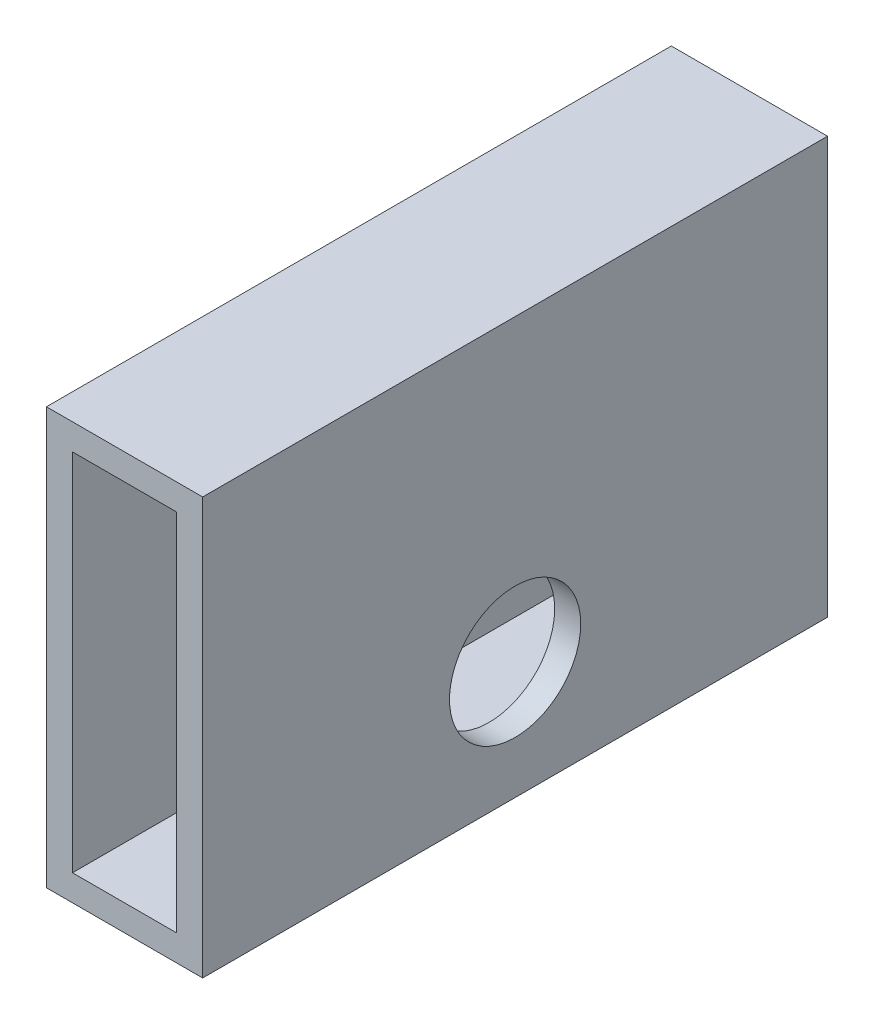
ISO-10303-21;
HEADER;
FILE_DESCRIPTION(('STEP AP214'),'2;1');
FILE_NAME('part.step','',(''),(''),'','','');
FILE_SCHEMA(('AUTOMOTIVE_DESIGN { 1 0 10303 214 1 1 1 1 }'));
ENDSEC;
DATA;
#1=APPLICATION_CONTEXT('core data for automotive mechanical design processes');
#2=APPLICATION_PROTOCOL_DEFINITION('international standard','automotive_design',2000,#1);
#3=PRODUCT_CONTEXT('',#1,'mechanical');
#4=PRODUCT('Part','Part','',(#3));
#5=PRODUCT_RELATED_PRODUCT_CATEGORY('part','',(#4));
#6=PRODUCT_DEFINITION_FORMATION('','',#4);
#7=PRODUCT_DEFINITION_CONTEXT('part definition',#1,'design');
#8=PRODUCT_DEFINITION('design','',#6,#7);
#9=PRODUCT_DEFINITION_SHAPE('','',#8);
#10=(LENGTH_UNIT() NAMED_UNIT(*) SI_UNIT(.MILLI.,.METRE.));
#11=(NAMED_UNIT(*) PLANE_ANGLE_UNIT() SI_UNIT($,.RADIAN.));
#12=(NAMED_UNIT(*) SI_UNIT($,.STERADIAN.) SOLID_ANGLE_UNIT());
#13=UNCERTAINTY_MEASURE_WITH_UNIT(LENGTH_MEASURE(1.E-05),#10,'distance_accuracy_value','');
#14=(GEOMETRIC_REPRESENTATION_CONTEXT(3) GLOBAL_UNCERTAINTY_ASSIGNED_CONTEXT((#13)) GLOBAL_UNIT_ASSIGNED_CONTEXT((#10,
#11,#12)) REPRESENTATION_CONTEXT('',''));
#15=CARTESIAN_POINT('',(0.,0.,0.));
#16=DIRECTION('',(0.,0.,1.));
#17=DIRECTION('',(1.,0.,0.));
#18=AXIS2_PLACEMENT_3D('',#15,#16,#17);
#19=CARTESIAN_POINT('',(9.525,-25.4,-76.2));
#20=DIRECTION('',(1.,0.,0.));
#21=DIRECTION('',(0.,0.,-1.));
#22=AXIS2_PLACEMENT_3D('',#19,#20,#21);
#23=PLANE('',#22);
#24=CARTESIAN_POINT('',(9.525,-11.049,-38.1));
#25=DIRECTION('',(1.,0.,0.));
#26=DIRECTION('',(0.,0.,-1.));
#27=AXIS2_PLACEMENT_3D('',#24,#25,#26);
#28=CIRCLE('',#27,8.001);
#29=CARTESIAN_POINT('',(9.525,-11.049,-46.101));
#30=VERTEX_POINT('',#29);
#31=EDGE_CURVE('E220',#30,#30,#28,.T.);
#32=ORIENTED_EDGE('',*,*,#31,.F.);
#33=EDGE_LOOP('',(#32));
#34=FACE_BOUND('',#33,.T.);
#35=DIRECTION('',(0.,1.,0.));
#36=VECTOR('',#35,1.);
#37=CARTESIAN_POINT('',(9.525,-25.4,0.));
#38=LINE('',#37,#36);
#39=CARTESIAN_POINT('',(9.525,-25.4,0.));
#40=VERTEX_POINT('',#39);
#41=CARTESIAN_POINT('',(9.525,25.4,0.));
#42=VERTEX_POINT('',#41);
#43=EDGE_CURVE('E112',#40,#42,#38,.T.);
#44=ORIENTED_EDGE('',*,*,#43,.F.);
#45=DIRECTION('',(0.,0.,1.));
#46=VECTOR('',#45,1.);
#47=CARTESIAN_POINT('',(9.525,-25.4,-76.2));
#48=LINE('',#47,#46);
#49=CARTESIAN_POINT('',(9.525,-25.4,-76.2));
#50=VERTEX_POINT('',#49);
#51=EDGE_CURVE('E11',#50,#40,#48,.T.);
#52=ORIENTED_EDGE('',*,*,#51,.F.);
#53=DIRECTION('',(0.,1.,0.));
#54=VECTOR('',#53,1.);
#55=CARTESIAN_POINT('',(9.525,-25.4,-76.2));
#56=LINE('',#55,#54);
#57=CARTESIAN_POINT('',(9.525,25.4,-76.2));
#58=VERTEX_POINT('',#57);
#59=EDGE_CURVE('E151',#50,#58,#56,.T.);
#60=ORIENTED_EDGE('',*,*,#59,.T.);
#61=DIRECTION('',(0.,0.,1.));
#62=VECTOR('',#61,1.);
#63=CARTESIAN_POINT('',(9.525,25.4,-76.2));
#64=LINE('',#63,#62);
#65=EDGE_CURVE('E168',#58,#42,#64,.T.);
#66=ORIENTED_EDGE('',*,*,#65,.T.);
#67=EDGE_LOOP('',(#44,#52,#60,#66));
#68=FACE_BOUND('',#67,.T.);
#69=ADVANCED_FACE('F39',(#34,#68),#23,.T.);
#70=CARTESIAN_POINT('',(-9.525,-25.4,-76.2));
#71=DIRECTION('',(0.,-1.,0.));
#72=DIRECTION('',(0.,0.,-1.));
#73=AXIS2_PLACEMENT_3D('',#70,#71,#72);
#74=PLANE('',#73);
#75=DIRECTION('',(1.,0.,0.));
#76=VECTOR('',#75,1.);
#77=CARTESIAN_POINT('',(-9.525,-25.4,0.));
#78=LINE('',#77,#76);
#79=CARTESIAN_POINT('',(-9.525,-25.4,0.));
#80=VERTEX_POINT('',#79);
#81=EDGE_CURVE('E156',#80,#40,#78,.T.);
#82=ORIENTED_EDGE('',*,*,#81,.F.);
#83=DIRECTION('',(0.,0.,1.));
#84=VECTOR('',#83,1.);
#85=CARTESIAN_POINT('',(-9.525,-25.4,-76.2));
#86=LINE('',#85,#84);
#87=CARTESIAN_POINT('',(-9.525,-25.4,-76.2));
#88=VERTEX_POINT('',#87);
#89=EDGE_CURVE('E48',#88,#80,#86,.T.);
#90=ORIENTED_EDGE('',*,*,#89,.F.);
#91=DIRECTION('',(1.,0.,0.));
#92=VECTOR('',#91,1.);
#93=CARTESIAN_POINT('',(-9.525,-25.4,-76.2));
#94=LINE('',#93,#92);
#95=EDGE_CURVE('E164',#88,#50,#94,.T.);
#96=ORIENTED_EDGE('',*,*,#95,.T.);
#97=ORIENTED_EDGE('',*,*,#51,.T.);
#98=EDGE_LOOP('',(#82,#90,#96,#97));
#99=FACE_BOUND('',#98,.T.);
#100=ADVANCED_FACE('F200',(#99),#74,.T.);
#101=CARTESIAN_POINT('',(-9.525,-25.4,-76.2));
#102=DIRECTION('',(-1.,0.,0.));
#103=DIRECTION('',(0.,0.,1.));
#104=AXIS2_PLACEMENT_3D('',#101,#102,#103);
#105=PLANE('',#104);
#106=CARTESIAN_POINT('',(-9.525,-11.049,-38.1));
#107=DIRECTION('',(1.,0.,0.));
#108=DIRECTION('',(0.,0.,-1.));
#109=AXIS2_PLACEMENT_3D('',#106,#107,#108);
#110=CIRCLE('',#109,8.001);
#111=CARTESIAN_POINT('',(-9.525,-11.049,-46.101));
#112=VERTEX_POINT('',#111);
#113=EDGE_CURVE('E223',#112,#112,#110,.T.);
#114=ORIENTED_EDGE('',*,*,#113,.T.);
#115=EDGE_LOOP('',(#114));
#116=FACE_BOUND('',#115,.T.);
#117=DIRECTION('',(0.,-1.,0.));
#118=VECTOR('',#117,1.);
#119=CARTESIAN_POINT('',(-9.525,-25.4,0.));
#120=LINE('',#119,#118);
#121=CARTESIAN_POINT('',(-9.525,25.4,0.));
#122=VERTEX_POINT('',#121);
#123=EDGE_CURVE('E176',#122,#80,#120,.T.);
#124=ORIENTED_EDGE('',*,*,#123,.F.);
#125=DIRECTION('',(0.,0.,1.));
#126=VECTOR('',#125,1.);
#127=CARTESIAN_POINT('',(-9.525,25.4,-76.2));
#128=LINE('',#127,#126);
#129=CARTESIAN_POINT('',(-9.525,25.4,-76.2));
#130=VERTEX_POINT('',#129);
#131=EDGE_CURVE('E185',#130,#122,#128,.T.);
#132=ORIENTED_EDGE('',*,*,#131,.F.);
#133=DIRECTION('',(0.,-1.,0.));
#134=VECTOR('',#133,1.);
#135=CARTESIAN_POINT('',(-9.525,-25.4,-76.2));
#136=LINE('',#135,#134);
#137=EDGE_CURVE('E160',#130,#88,#136,.T.);
#138=ORIENTED_EDGE('',*,*,#137,.T.);
#139=ORIENTED_EDGE('',*,*,#89,.T.);
#140=EDGE_LOOP('',(#124,#132,#138,#139));
#141=FACE_BOUND('',#140,.T.);
#142=ADVANCED_FACE('F204',(#116,#141),#105,.T.);
#143=CARTESIAN_POINT('',(-9.525,25.4,-76.2));
#144=DIRECTION('',(0.,1.,0.));
#145=DIRECTION('',(0.,0.,1.));
#146=AXIS2_PLACEMENT_3D('',#143,#144,#145);
#147=PLANE('',#146);
#148=DIRECTION('',(-1.,0.,0.));
#149=VECTOR('',#148,1.);
#150=CARTESIAN_POINT('',(-9.525,25.4,0.));
#151=LINE('',#150,#149);
#152=EDGE_CURVE('E172',#42,#122,#151,.T.);
#153=ORIENTED_EDGE('',*,*,#152,.F.);
#154=ORIENTED_EDGE('',*,*,#65,.F.);
#155=DIRECTION('',(-1.,0.,0.));
#156=VECTOR('',#155,1.);
#157=CARTESIAN_POINT('',(-9.525,25.4,-76.2));
#158=LINE('',#157,#156);
#159=EDGE_CURVE('E155',#58,#130,#158,.T.);
#160=ORIENTED_EDGE('',*,*,#159,.T.);
#161=ORIENTED_EDGE('',*,*,#131,.T.);
#162=EDGE_LOOP('',(#153,#154,#160,#161));
#163=FACE_BOUND('',#162,.T.);
#164=ADVANCED_FACE('F194',(#163),#147,.T.);
#165=CARTESIAN_POINT('',(0.,0.,-76.2));
#166=DIRECTION('',(0.,0.,-1.));
#167=DIRECTION('',(-1.,0.,0.));
#168=AXIS2_PLACEMENT_3D('',#165,#166,#167);
#169=PLANE('',#168);
#170=DIRECTION('',(0.,1.,0.));
#171=VECTOR('',#170,1.);
#172=CARTESIAN_POINT('',(6.35,-22.225,-76.2));
#173=LINE('',#172,#171);
#174=CARTESIAN_POINT('',(6.35,-22.225,-76.2));
#175=VERTEX_POINT('',#174);
#176=CARTESIAN_POINT('',(6.35,22.225,-76.2));
#177=VERTEX_POINT('',#176);
#178=EDGE_CURVE('E116',#175,#177,#173,.T.);
#179=ORIENTED_EDGE('',*,*,#178,.T.);
#180=DIRECTION('',(-1.,0.,0.));
#181=VECTOR('',#180,1.);
#182=CARTESIAN_POINT('',(-6.35,22.225,-76.2));
#183=LINE('',#182,#181);
#184=CARTESIAN_POINT('',(-6.35,22.225,-76.2));
#185=VERTEX_POINT('',#184);
#186=EDGE_CURVE('E104',#177,#185,#183,.T.);
#187=ORIENTED_EDGE('',*,*,#186,.T.);
#188=DIRECTION('',(0.,-1.,0.));
#189=VECTOR('',#188,1.);
#190=CARTESIAN_POINT('',(-6.35,-22.225,-76.2));
#191=LINE('',#190,#189);
#192=CARTESIAN_POINT('',(-6.35,-22.225,-76.2));
#193=VERTEX_POINT('',#192);
#194=EDGE_CURVE('E131',#185,#193,#191,.T.);
#195=ORIENTED_EDGE('',*,*,#194,.T.);
#196=DIRECTION('',(1.,0.,0.));
#197=VECTOR('',#196,1.);
#198=CARTESIAN_POINT('',(-6.35,-22.225,-76.2));
#199=LINE('',#198,#197);
#200=EDGE_CURVE('E124',#193,#175,#199,.T.);
#201=ORIENTED_EDGE('',*,*,#200,.T.);
#202=EDGE_LOOP('',(#179,#187,#195,#201));
#203=FACE_BOUND('',#202,.T.);
#204=ORIENTED_EDGE('',*,*,#59,.F.);
#205=ORIENTED_EDGE('',*,*,#95,.F.);
#206=ORIENTED_EDGE('',*,*,#137,.F.);
#207=ORIENTED_EDGE('',*,*,#159,.F.);
#208=EDGE_LOOP('',(#204,#205,#206,#207));
#209=FACE_BOUND('',#208,.T.);
#210=ADVANCED_FACE('F122',(#203,#209),#169,.T.);
#211=CARTESIAN_POINT('',(0.,0.,0.));
#212=DIRECTION('',(0.,0.,-1.));
#213=DIRECTION('',(-1.,0.,0.));
#214=AXIS2_PLACEMENT_3D('',#211,#212,#213);
#215=PLANE('',#214);
#216=DIRECTION('',(-1.,0.,0.));
#217=VECTOR('',#216,1.);
#218=CARTESIAN_POINT('',(-6.35,22.225,0.));
#219=LINE('',#218,#217);
#220=CARTESIAN_POINT('',(6.35,22.225,0.));
#221=VERTEX_POINT('',#220);
#222=CARTESIAN_POINT('',(-6.35,22.225,0.));
#223=VERTEX_POINT('',#222);
#224=EDGE_CURVE('E129',#221,#223,#219,.T.);
#225=ORIENTED_EDGE('',*,*,#224,.F.);
#226=DIRECTION('',(0.,1.,0.));
#227=VECTOR('',#226,1.);
#228=CARTESIAN_POINT('',(6.35,-22.225,0.));
#229=LINE('',#228,#227);
#230=CARTESIAN_POINT('',(6.35,-22.225,0.));
#231=VERTEX_POINT('',#230);
#232=EDGE_CURVE('E64',#231,#221,#229,.T.);
#233=ORIENTED_EDGE('',*,*,#232,.F.);
#234=DIRECTION('',(1.,0.,0.));
#235=VECTOR('',#234,1.);
#236=CARTESIAN_POINT('',(-6.35,-22.225,0.));
#237=LINE('',#236,#235);
#238=CARTESIAN_POINT('',(-6.35,-22.225,0.));
#239=VERTEX_POINT('',#238);
#240=EDGE_CURVE('E119',#239,#231,#237,.T.);
#241=ORIENTED_EDGE('',*,*,#240,.F.);
#242=DIRECTION('',(0.,-1.,0.));
#243=VECTOR('',#242,1.);
#244=CARTESIAN_POINT('',(-6.35,-22.225,0.));
#245=LINE('',#244,#243);
#246=EDGE_CURVE('E137',#223,#239,#245,.T.);
#247=ORIENTED_EDGE('',*,*,#246,.F.);
#248=EDGE_LOOP('',(#225,#233,#241,#247));
#249=FACE_BOUND('',#248,.T.);
#250=ORIENTED_EDGE('',*,*,#43,.T.);
#251=ORIENTED_EDGE('',*,*,#152,.T.);
#252=ORIENTED_EDGE('',*,*,#123,.T.);
#253=ORIENTED_EDGE('',*,*,#81,.T.);
#254=EDGE_LOOP('',(#250,#251,#252,#253));
#255=FACE_BOUND('',#254,.T.);
#256=ADVANCED_FACE('F197',(#249,#255),#215,.F.);
#257=CARTESIAN_POINT('',(6.35,-22.225,-76.201));
#258=DIRECTION('',(1.,0.,0.));
#259=DIRECTION('',(0.,0.,-1.));
#260=AXIS2_PLACEMENT_3D('',#257,#258,#259);
#261=PLANE('',#260);
#262=CARTESIAN_POINT('',(6.35,-11.049,-38.1));
#263=DIRECTION('',(1.,0.,0.));
#264=DIRECTION('',(0.,0.,-1.));
#265=AXIS2_PLACEMENT_3D('',#262,#263,#264);
#266=CIRCLE('',#265,8.001);
#267=CARTESIAN_POINT('',(6.35,-11.049,-46.101));
#268=VERTEX_POINT('',#267);
#269=EDGE_CURVE('E228',#268,#268,#266,.T.);
#270=ORIENTED_EDGE('',*,*,#269,.T.);
#271=EDGE_LOOP('',(#270));
#272=FACE_BOUND('',#271,.T.);
#273=DIRECTION('',(0.,0.,1.));
#274=VECTOR('',#273,1.);
#275=CARTESIAN_POINT('',(6.35,-22.225,-76.201));
#276=LINE('',#275,#274);
#277=EDGE_CURVE('E113',#175,#231,#276,.T.);
#278=ORIENTED_EDGE('',*,*,#277,.T.);
#279=ORIENTED_EDGE('',*,*,#232,.T.);
#280=DIRECTION('',(0.,0.,1.));
#281=VECTOR('',#280,1.);
#282=CARTESIAN_POINT('',(6.35,22.225,-76.201));
#283=LINE('',#282,#281);
#284=EDGE_CURVE('E106',#177,#221,#283,.T.);
#285=ORIENTED_EDGE('',*,*,#284,.F.);
#286=ORIENTED_EDGE('',*,*,#178,.F.);
#287=EDGE_LOOP('',(#278,#279,#285,#286));
#288=FACE_BOUND('',#287,.T.);
#289=ADVANCED_FACE('F115',(#272,#288),#261,.F.);
#290=CARTESIAN_POINT('',(-6.35,-22.225,-76.201));
#291=DIRECTION('',(0.,-1.,0.));
#292=DIRECTION('',(0.,0.,-1.));
#293=AXIS2_PLACEMENT_3D('',#290,#291,#292);
#294=PLANE('',#293);
#295=DIRECTION('',(0.,0.,1.));
#296=VECTOR('',#295,1.);
#297=CARTESIAN_POINT('',(-6.35,-22.225,-76.201));
#298=LINE('',#297,#296);
#299=EDGE_CURVE('E146',#193,#239,#298,.T.);
#300=ORIENTED_EDGE('',*,*,#299,.T.);
#301=ORIENTED_EDGE('',*,*,#240,.T.);
#302=ORIENTED_EDGE('',*,*,#277,.F.);
#303=ORIENTED_EDGE('',*,*,#200,.F.);
#304=EDGE_LOOP('',(#300,#301,#302,#303));
#305=FACE_BOUND('',#304,.T.);
#306=ADVANCED_FACE('F238',(#305),#294,.F.);
#307=CARTESIAN_POINT('',(-6.35,-22.225,-76.201));
#308=DIRECTION('',(-1.,0.,0.));
#309=DIRECTION('',(0.,0.,1.));
#310=AXIS2_PLACEMENT_3D('',#307,#308,#309);
#311=PLANE('',#310);
#312=CARTESIAN_POINT('',(-6.35,-11.049,-38.1));
#313=DIRECTION('',(-1.,0.,0.));
#314=DIRECTION('',(0.,0.,1.));
#315=AXIS2_PLACEMENT_3D('',#312,#313,#314);
#316=CIRCLE('',#315,8.001);
#317=CARTESIAN_POINT('',(-6.35,-11.049,-30.099));
#318=VERTEX_POINT('',#317);
#319=EDGE_CURVE('E42',#318,#318,#316,.T.);
#320=ORIENTED_EDGE('',*,*,#319,.T.);
#321=EDGE_LOOP('',(#320));
#322=FACE_BOUND('',#321,.T.);
#323=DIRECTION('',(0.,0.,1.));
#324=VECTOR('',#323,1.);
#325=CARTESIAN_POINT('',(-6.35,22.225,-76.201));
#326=LINE('',#325,#324);
#327=EDGE_CURVE('E56',#185,#223,#326,.T.);
#328=ORIENTED_EDGE('',*,*,#327,.T.);
#329=ORIENTED_EDGE('',*,*,#246,.T.);
#330=ORIENTED_EDGE('',*,*,#299,.F.);
#331=ORIENTED_EDGE('',*,*,#194,.F.);
#332=EDGE_LOOP('',(#328,#329,#330,#331));
#333=FACE_BOUND('',#332,.T.);
#334=ADVANCED_FACE('F234',(#322,#333),#311,.F.);
#335=CARTESIAN_POINT('',(-6.35,22.225,-76.201));
#336=DIRECTION('',(0.,1.,0.));
#337=DIRECTION('',(0.,0.,1.));
#338=AXIS2_PLACEMENT_3D('',#335,#336,#337);
#339=PLANE('',#338);
#340=ORIENTED_EDGE('',*,*,#284,.T.);
#341=ORIENTED_EDGE('',*,*,#224,.T.);
#342=ORIENTED_EDGE('',*,*,#327,.F.);
#343=ORIENTED_EDGE('',*,*,#186,.F.);
#344=EDGE_LOOP('',(#340,#341,#342,#343));
#345=FACE_BOUND('',#344,.T.);
#346=ADVANCED_FACE('F105',(#345),#339,.F.);
#347=CARTESIAN_POINT('',(-9.525,-11.049,-38.1));
#348=DIRECTION('',(1.,0.,0.));
#349=DIRECTION('',(0.,0.,-1.));
#350=AXIS2_PLACEMENT_3D('',#347,#348,#349);
#351=CYLINDRICAL_SURFACE('',#350,8.001);
#352=ORIENTED_EDGE('',*,*,#113,.F.);
#353=EDGE_LOOP('',(#352));
#354=FACE_BOUND('',#353,.T.);
#355=ORIENTED_EDGE('',*,*,#319,.F.);
#356=EDGE_LOOP('',(#355));
#357=FACE_BOUND('',#356,.T.);
#358=ADVANCED_FACE('F252',(#354,#357),#351,.F.);
#359=ORIENTED_EDGE('',*,*,#31,.T.);
#360=EDGE_LOOP('',(#359));
#361=FACE_BOUND('',#360,.T.);
#362=ORIENTED_EDGE('',*,*,#269,.F.);
#363=EDGE_LOOP('',(#362));
#364=FACE_BOUND('',#363,.T.);
#365=ADVANCED_FACE('F258',(#361,#364),#351,.F.);
#366=CLOSED_SHELL('',(#69,#100,#142,#164,#210,#256,#289,#306,#334,#346,#358,#365));
#367=MANIFOLD_SOLID_BREP('B2',#366);
#368=ADVANCED_BREP_SHAPE_REPRESENTATION('',(#18,#367),#14);
#369=SHAPE_DEFINITION_REPRESENTATION(#9,#368);
ENDSEC;
END-ISO-10303-21;
